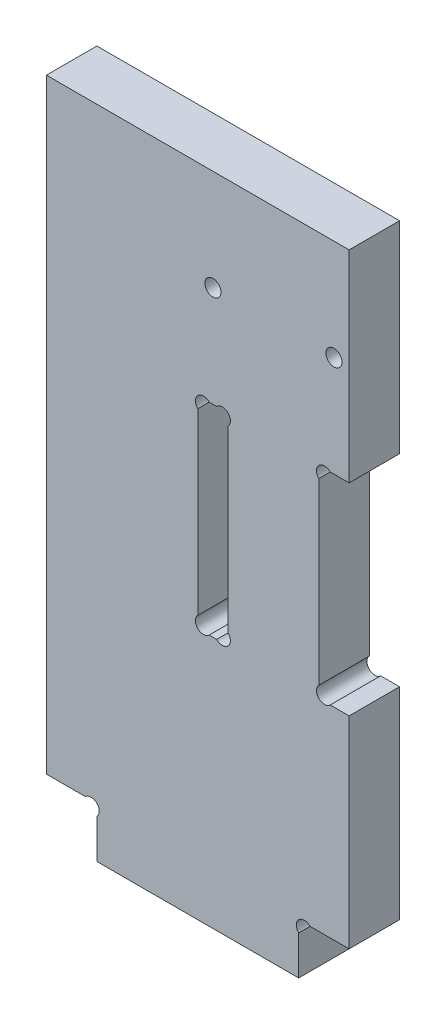
ISO-10303-21;
HEADER;
FILE_DESCRIPTION(('STEP AP214'),'2;1');
FILE_NAME('part.step','',(''),(''),'','','');
FILE_SCHEMA(('AUTOMOTIVE_DESIGN { 1 0 10303 214 1 1 1 1 }'));
ENDSEC;
DATA;
#1=APPLICATION_CONTEXT('core data for automotive mechanical design processes');
#2=APPLICATION_PROTOCOL_DEFINITION('international standard','automotive_design',2000,#1);
#3=PRODUCT_CONTEXT('',#1,'mechanical');
#4=PRODUCT('Part','Part','',(#3));
#5=PRODUCT_RELATED_PRODUCT_CATEGORY('part','',(#4));
#6=PRODUCT_DEFINITION_FORMATION('','',#4);
#7=PRODUCT_DEFINITION_CONTEXT('part definition',#1,'design');
#8=PRODUCT_DEFINITION('design','',#6,#7);
#9=PRODUCT_DEFINITION_SHAPE('','',#8);
#10=(LENGTH_UNIT() NAMED_UNIT(*) SI_UNIT(.MILLI.,.METRE.));
#11=(NAMED_UNIT(*) PLANE_ANGLE_UNIT() SI_UNIT($,.RADIAN.));
#12=(NAMED_UNIT(*) SI_UNIT($,.STERADIAN.) SOLID_ANGLE_UNIT());
#13=UNCERTAINTY_MEASURE_WITH_UNIT(LENGTH_MEASURE(1.E-05),#10,'distance_accuracy_value','');
#14=(GEOMETRIC_REPRESENTATION_CONTEXT(3) GLOBAL_UNCERTAINTY_ASSIGNED_CONTEXT((#13)) GLOBAL_UNIT_ASSIGNED_CONTEXT((#10,
#11,#12)) REPRESENTATION_CONTEXT('',''));
#15=CARTESIAN_POINT('',(0.,0.,0.));
#16=DIRECTION('',(0.,0.,1.));
#17=DIRECTION('',(1.,0.,0.));
#18=AXIS2_PLACEMENT_3D('',#15,#16,#17);
#19=CARTESIAN_POINT('',(278.868629150101,8.86862915010152,10.));
#20=DIRECTION('',(0.,0.,1.));
#21=DIRECTION('',(1.,0.,0.));
#22=AXIS2_PLACEMENT_3D('',#19,#20,#21);
#23=PLANE('',#22);
#24=CARTESIAN_POINT('',(327.,110.,10.));
#25=DIRECTION('',(0.,0.,1.));
#26=DIRECTION('',(-1.,0.,0.));
#27=AXIS2_PLACEMENT_3D('',#24,#25,#26);
#28=CIRCLE('',#27,1.59999999999996);
#29=CARTESIAN_POINT('',(325.4,110.,10.));
#30=VERTEX_POINT('',#29);
#31=EDGE_CURVE('E220',#30,#30,#28,.T.);
#32=ORIENTED_EDGE('',*,*,#31,.F.);
#33=EDGE_LOOP('',(#32));
#34=FACE_BOUND('',#33,.T.);
#35=DIRECTION('',(0.,1.,0.));
#36=VECTOR('',#35,1.);
#37=CARTESIAN_POINT('',(330.,90.0000000000001,10.));
#38=LINE('',#37,#36);
#39=CARTESIAN_POINT('',(330.,90.0000000000001,10.));
#40=VERTEX_POINT('',#39);
#41=CARTESIAN_POINT('',(330.,130.,10.));
#42=VERTEX_POINT('',#41);
#43=EDGE_CURVE('E299',#40,#42,#38,.T.);
#44=ORIENTED_EDGE('',*,*,#43,.T.);
#45=DIRECTION('',(-1.,0.,0.));
#46=VECTOR('',#45,1.);
#47=CARTESIAN_POINT('',(330.,130.,10.));
#48=LINE('',#47,#46);
#49=CARTESIAN_POINT('',(270.,130.,10.));
#50=VERTEX_POINT('',#49);
#51=EDGE_CURVE('E302',#42,#50,#48,.T.);
#52=ORIENTED_EDGE('',*,*,#51,.T.);
#53=DIRECTION('',(0.,-1.,0.));
#54=VECTOR('',#53,1.);
#55=CARTESIAN_POINT('',(270.,130.,10.));
#56=LINE('',#55,#54);
#57=CARTESIAN_POINT('',(270.,9.99999999999999,10.));
#58=VERTEX_POINT('',#57);
#59=EDGE_CURVE('E304',#50,#58,#56,.T.);
#60=ORIENTED_EDGE('',*,*,#59,.T.);
#61=DIRECTION('',(1.,0.,0.));
#62=VECTOR('',#61,1.);
#63=CARTESIAN_POINT('',(270.,9.99999999999999,10.));
#64=LINE('',#63,#62);
#65=CARTESIAN_POINT('',(277.737258300203,10.,10.));
#66=VERTEX_POINT('',#65);
#67=EDGE_CURVE('E306',#58,#66,#64,.T.);
#68=ORIENTED_EDGE('',*,*,#67,.T.);
#69=CARTESIAN_POINT('',(278.868629150101,8.86862915010152,10.));
#70=DIRECTION('',(0.,0.,-1.));
#71=DIRECTION('',(1.,0.,0.));
#72=AXIS2_PLACEMENT_3D('',#69,#70,#71);
#73=CIRCLE('',#72,1.59999999999998);
#74=CARTESIAN_POINT('',(280.,7.73725830020305,10.));
#75=VERTEX_POINT('',#74);
#76=EDGE_CURVE('E308',#66,#75,#73,.T.);
#77=ORIENTED_EDGE('',*,*,#76,.T.);
#78=DIRECTION('',(0.,-1.,0.));
#79=VECTOR('',#78,1.);
#80=CARTESIAN_POINT('',(280.,7.73725830020305,10.));
#81=LINE('',#80,#79);
#82=CARTESIAN_POINT('',(280.,0.,10.));
#83=VERTEX_POINT('',#82);
#84=EDGE_CURVE('E310',#75,#83,#81,.T.);
#85=ORIENTED_EDGE('',*,*,#84,.T.);
#86=DIRECTION('',(1.,0.,0.));
#87=VECTOR('',#86,1.);
#88=CARTESIAN_POINT('',(320.,0.,10.));
#89=LINE('',#88,#87);
#90=CARTESIAN_POINT('',(320.,0.,10.));
#91=VERTEX_POINT('',#90);
#92=EDGE_CURVE('E312',#83,#91,#89,.T.);
#93=ORIENTED_EDGE('',*,*,#92,.T.);
#94=DIRECTION('',(0.,1.,0.));
#95=VECTOR('',#94,1.);
#96=CARTESIAN_POINT('',(320.,7.73725830020305,10.));
#97=LINE('',#96,#95);
#98=CARTESIAN_POINT('',(320.,7.73725830020306,10.));
#99=VERTEX_POINT('',#98);
#100=EDGE_CURVE('E314',#91,#99,#97,.T.);
#101=ORIENTED_EDGE('',*,*,#100,.T.);
#102=CARTESIAN_POINT('',(321.131370849899,8.86862915010152,10.));
#103=DIRECTION('',(0.,0.,-1.));
#104=DIRECTION('',(-1.,0.,0.));
#105=AXIS2_PLACEMENT_3D('',#102,#103,#104);
#106=CIRCLE('',#105,1.6);
#107=CARTESIAN_POINT('',(322.262741699797,10.,10.));
#108=VERTEX_POINT('',#107);
#109=EDGE_CURVE('E316',#99,#108,#106,.T.);
#110=ORIENTED_EDGE('',*,*,#109,.T.);
#111=DIRECTION('',(1.,0.,0.));
#112=VECTOR('',#111,1.);
#113=CARTESIAN_POINT('',(322.262741699797,10.,10.));
#114=LINE('',#113,#112);
#115=CARTESIAN_POINT('',(330.,10.,10.));
#116=VERTEX_POINT('',#115);
#117=EDGE_CURVE('E318',#108,#116,#114,.T.);
#118=ORIENTED_EDGE('',*,*,#117,.T.);
#119=DIRECTION('',(0.,1.,0.));
#120=VECTOR('',#119,1.);
#121=CARTESIAN_POINT('',(330.,10.,10.));
#122=LINE('',#121,#120);
#123=CARTESIAN_POINT('',(330.,50.,10.));
#124=VERTEX_POINT('',#123);
#125=EDGE_CURVE('E320',#116,#124,#122,.T.);
#126=ORIENTED_EDGE('',*,*,#125,.T.);
#127=DIRECTION('',(-1.,0.,0.));
#128=VECTOR('',#127,1.);
#129=CARTESIAN_POINT('',(326.262741699797,50.,10.));
#130=LINE('',#129,#128);
#131=CARTESIAN_POINT('',(326.262741699797,50.,10.));
#132=VERTEX_POINT('',#131);
#133=EDGE_CURVE('E322',#124,#132,#130,.T.);
#134=ORIENTED_EDGE('',*,*,#133,.T.);
#135=CARTESIAN_POINT('',(325.131370849898,51.1313708498985,10.));
#136=DIRECTION('',(0.,0.,-1.));
#137=DIRECTION('',(-1.,0.,0.));
#138=AXIS2_PLACEMENT_3D('',#135,#136,#137);
#139=CIRCLE('',#138,1.59999999999995);
#140=CARTESIAN_POINT('',(324.,52.2627416997971,10.));
#141=VERTEX_POINT('',#140);
#142=EDGE_CURVE('E324',#132,#141,#139,.T.);
#143=ORIENTED_EDGE('',*,*,#142,.T.);
#144=DIRECTION('',(0.,1.,0.));
#145=VECTOR('',#144,1.);
#146=CARTESIAN_POINT('',(324.,87.7372583002031,10.));
#147=LINE('',#146,#145);
#148=CARTESIAN_POINT('',(324.,87.7372583002031,10.));
#149=VERTEX_POINT('',#148);
#150=EDGE_CURVE('E326',#141,#149,#147,.T.);
#151=ORIENTED_EDGE('',*,*,#150,.T.);
#152=CARTESIAN_POINT('',(325.131370849898,88.8686291501016,10.));
#153=DIRECTION('',(0.,0.,-1.));
#154=DIRECTION('',(1.,0.,0.));
#155=AXIS2_PLACEMENT_3D('',#152,#153,#154);
#156=CIRCLE('',#155,1.59999999999996);
#157=CARTESIAN_POINT('',(326.262741699797,90.0000000000001,10.));
#158=VERTEX_POINT('',#157);
#159=EDGE_CURVE('E328',#149,#158,#156,.T.);
#160=ORIENTED_EDGE('',*,*,#159,.T.);
#161=DIRECTION('',(1.,0.,0.));
#162=VECTOR('',#161,1.);
#163=CARTESIAN_POINT('',(326.262741699797,90.0000000000001,10.));
#164=LINE('',#163,#162);
#165=EDGE_CURVE('E330',#158,#40,#164,.T.);
#166=ORIENTED_EDGE('',*,*,#165,.T.);
#167=EDGE_LOOP('',(#44,#52,#60,#68,#77,#85,#93,#101,#110,#118,#126,#134,#143,#151,#160,#166));
#168=FACE_BOUND('',#167,.T.);
#169=DIRECTION('',(0.,1.,0.));
#170=VECTOR('',#169,1.);
#171=CARTESIAN_POINT('',(306.,52.2627416997969,10.));
#172=LINE('',#171,#170);
#173=CARTESIAN_POINT('',(306.,52.2627416997969,10.));
#174=VERTEX_POINT('',#173);
#175=CARTESIAN_POINT('',(306.,87.7372583002031,10.));
#176=VERTEX_POINT('',#175);
#177=EDGE_CURVE('E241',#174,#176,#172,.T.);
#178=ORIENTED_EDGE('',*,*,#177,.F.);
#179=CARTESIAN_POINT('',(304.868629150102,51.1313708498985,10.));
#180=DIRECTION('',(0.,0.,1.));
#181=DIRECTION('',(1.,0.,0.));
#182=AXIS2_PLACEMENT_3D('',#179,#180,#181);
#183=CIRCLE('',#182,1.59999999999995);
#184=CARTESIAN_POINT('',(303.737258300203,50.,10.));
#185=VERTEX_POINT('',#184);
#186=EDGE_CURVE('E212',#185,#174,#183,.T.);
#187=ORIENTED_EDGE('',*,*,#186,.F.);
#188=DIRECTION('',(1.,0.,0.));
#189=VECTOR('',#188,1.);
#190=CARTESIAN_POINT('',(302.262741699797,50.,10.));
#191=LINE('',#190,#189);
#192=CARTESIAN_POINT('',(302.262741699797,50.,10.));
#193=VERTEX_POINT('',#192);
#194=EDGE_CURVE('E253',#193,#185,#191,.T.);
#195=ORIENTED_EDGE('',*,*,#194,.F.);
#196=CARTESIAN_POINT('',(301.131370849898,51.1313708498985,10.));
#197=DIRECTION('',(0.,0.,1.));
#198=DIRECTION('',(-1.,0.,0.));
#199=AXIS2_PLACEMENT_3D('',#196,#197,#198);
#200=CIRCLE('',#199,1.59999999999997);
#201=CARTESIAN_POINT('',(300.,52.262741699797,10.));
#202=VERTEX_POINT('',#201);
#203=EDGE_CURVE('E251',#202,#193,#200,.T.);
#204=ORIENTED_EDGE('',*,*,#203,.F.);
#205=DIRECTION('',(0.,-1.,0.));
#206=VECTOR('',#205,1.);
#207=CARTESIAN_POINT('',(300.,87.7372583002031,10.));
#208=LINE('',#207,#206);
#209=CARTESIAN_POINT('',(300.,87.7372583002031,10.));
#210=VERTEX_POINT('',#209);
#211=EDGE_CURVE('E249',#210,#202,#208,.T.);
#212=ORIENTED_EDGE('',*,*,#211,.F.);
#213=CARTESIAN_POINT('',(301.131370849898,88.8686291501016,10.));
#214=DIRECTION('',(0.,0.,1.));
#215=DIRECTION('',(1.,0.,0.));
#216=AXIS2_PLACEMENT_3D('',#213,#214,#215);
#217=CIRCLE('',#216,1.59999999999995);
#218=CARTESIAN_POINT('',(302.262741699797,90.0000000000001,10.));
#219=VERTEX_POINT('',#218);
#220=EDGE_CURVE('E247',#219,#210,#217,.T.);
#221=ORIENTED_EDGE('',*,*,#220,.F.);
#222=DIRECTION('',(-1.,0.,0.));
#223=VECTOR('',#222,1.);
#224=CARTESIAN_POINT('',(302.262741699797,90.0000000000001,10.));
#225=LINE('',#224,#223);
#226=CARTESIAN_POINT('',(303.737258300203,90.0000000000001,10.));
#227=VERTEX_POINT('',#226);
#228=EDGE_CURVE('E245',#227,#219,#225,.T.);
#229=ORIENTED_EDGE('',*,*,#228,.F.);
#230=CARTESIAN_POINT('',(304.868629150102,88.8686291501016,10.));
#231=DIRECTION('',(0.,0.,1.));
#232=DIRECTION('',(-1.,0.,0.));
#233=AXIS2_PLACEMENT_3D('',#230,#231,#232);
#234=CIRCLE('',#233,1.59999999999997);
#235=EDGE_CURVE('E243',#176,#227,#234,.T.);
#236=ORIENTED_EDGE('',*,*,#235,.F.);
#237=EDGE_LOOP('',(#178,#187,#195,#204,#212,#221,#229,#236));
#238=FACE_BOUND('',#237,.T.);
#239=CARTESIAN_POINT('',(303.,110.,10.));
#240=DIRECTION('',(0.,0.,1.));
#241=DIRECTION('',(1.,0.,0.));
#242=AXIS2_PLACEMENT_3D('',#239,#240,#241);
#243=CIRCLE('',#242,1.59999999999996);
#244=CARTESIAN_POINT('',(304.6,110.,10.));
#245=VERTEX_POINT('',#244);
#246=EDGE_CURVE('E701',#245,#245,#243,.T.);
#247=ORIENTED_EDGE('',*,*,#246,.F.);
#248=EDGE_LOOP('',(#247));
#249=FACE_BOUND('',#248,.T.);
#250=ADVANCED_FACE('F36',(#34,#168,#238,#249),#23,.T.);
#251=CARTESIAN_POINT('',(278.868629150101,8.86862915010152,0.));
#252=DIRECTION('',(0.,0.,1.));
#253=DIRECTION('',(1.,0.,0.));
#254=AXIS2_PLACEMENT_3D('',#251,#252,#253);
#255=PLANE('',#254);
#256=CARTESIAN_POINT('',(327.,110.,0.));
#257=DIRECTION('',(0.,0.,1.));
#258=DIRECTION('',(-1.,0.,0.));
#259=AXIS2_PLACEMENT_3D('',#256,#257,#258);
#260=CIRCLE('',#259,1.59999999999996);
#261=CARTESIAN_POINT('',(325.4,110.,0.));
#262=VERTEX_POINT('',#261);
#263=EDGE_CURVE('E223',#262,#262,#260,.T.);
#264=ORIENTED_EDGE('',*,*,#263,.T.);
#265=EDGE_LOOP('',(#264));
#266=FACE_BOUND('',#265,.T.);
#267=DIRECTION('',(0.,1.,0.));
#268=VECTOR('',#267,1.);
#269=CARTESIAN_POINT('',(330.,90.0000000000001,0.));
#270=LINE('',#269,#268);
#271=CARTESIAN_POINT('',(330.,90.0000000000001,0.));
#272=VERTEX_POINT('',#271);
#273=CARTESIAN_POINT('',(330.,130.,0.));
#274=VERTEX_POINT('',#273);
#275=EDGE_CURVE('E213',#272,#274,#270,.T.);
#276=ORIENTED_EDGE('',*,*,#275,.F.);
#277=DIRECTION('',(1.,0.,0.));
#278=VECTOR('',#277,1.);
#279=CARTESIAN_POINT('',(326.262741699797,90.0000000000001,0.));
#280=LINE('',#279,#278);
#281=CARTESIAN_POINT('',(326.262741699797,90.0000000000001,0.));
#282=VERTEX_POINT('',#281);
#283=EDGE_CURVE('E297',#282,#272,#280,.T.);
#284=ORIENTED_EDGE('',*,*,#283,.F.);
#285=CARTESIAN_POINT('',(325.131370849898,88.8686291501016,0.));
#286=DIRECTION('',(0.,0.,-1.));
#287=DIRECTION('',(1.,0.,0.));
#288=AXIS2_PLACEMENT_3D('',#285,#286,#287);
#289=CIRCLE('',#288,1.59999999999996);
#290=CARTESIAN_POINT('',(324.,87.7372583002031,0.));
#291=VERTEX_POINT('',#290);
#292=EDGE_CURVE('E295',#291,#282,#289,.T.);
#293=ORIENTED_EDGE('',*,*,#292,.F.);
#294=DIRECTION('',(0.,1.,0.));
#295=VECTOR('',#294,1.);
#296=CARTESIAN_POINT('',(324.,87.7372583002031,0.));
#297=LINE('',#296,#295);
#298=CARTESIAN_POINT('',(324.,52.2627416997971,0.));
#299=VERTEX_POINT('',#298);
#300=EDGE_CURVE('E293',#299,#291,#297,.T.);
#301=ORIENTED_EDGE('',*,*,#300,.F.);
#302=CARTESIAN_POINT('',(325.131370849898,51.1313708498985,0.));
#303=DIRECTION('',(0.,0.,-1.));
#304=DIRECTION('',(-1.,0.,0.));
#305=AXIS2_PLACEMENT_3D('',#302,#303,#304);
#306=CIRCLE('',#305,1.59999999999995);
#307=CARTESIAN_POINT('',(326.262741699797,50.,0.));
#308=VERTEX_POINT('',#307);
#309=EDGE_CURVE('E291',#308,#299,#306,.T.);
#310=ORIENTED_EDGE('',*,*,#309,.F.);
#311=DIRECTION('',(-1.,0.,0.));
#312=VECTOR('',#311,1.);
#313=CARTESIAN_POINT('',(326.262741699797,50.,0.));
#314=LINE('',#313,#312);
#315=CARTESIAN_POINT('',(330.,50.,0.));
#316=VERTEX_POINT('',#315);
#317=EDGE_CURVE('E289',#316,#308,#314,.T.);
#318=ORIENTED_EDGE('',*,*,#317,.F.);
#319=DIRECTION('',(0.,1.,0.));
#320=VECTOR('',#319,1.);
#321=CARTESIAN_POINT('',(330.,10.,0.));
#322=LINE('',#321,#320);
#323=CARTESIAN_POINT('',(330.,10.,0.));
#324=VERTEX_POINT('',#323);
#325=EDGE_CURVE('E287',#324,#316,#322,.T.);
#326=ORIENTED_EDGE('',*,*,#325,.F.);
#327=DIRECTION('',(1.,0.,0.));
#328=VECTOR('',#327,1.);
#329=CARTESIAN_POINT('',(322.262741699797,10.,0.));
#330=LINE('',#329,#328);
#331=CARTESIAN_POINT('',(322.262741699797,10.,0.));
#332=VERTEX_POINT('',#331);
#333=EDGE_CURVE('E285',#332,#324,#330,.T.);
#334=ORIENTED_EDGE('',*,*,#333,.F.);
#335=CARTESIAN_POINT('',(321.131370849899,8.86862915010152,0.));
#336=DIRECTION('',(0.,0.,-1.));
#337=DIRECTION('',(-1.,0.,0.));
#338=AXIS2_PLACEMENT_3D('',#335,#336,#337);
#339=CIRCLE('',#338,1.6);
#340=CARTESIAN_POINT('',(320.,7.73725830020306,0.));
#341=VERTEX_POINT('',#340);
#342=EDGE_CURVE('E283',#341,#332,#339,.T.);
#343=ORIENTED_EDGE('',*,*,#342,.F.);
#344=DIRECTION('',(0.,1.,0.));
#345=VECTOR('',#344,1.);
#346=CARTESIAN_POINT('',(320.,7.73725830020305,0.));
#347=LINE('',#346,#345);
#348=CARTESIAN_POINT('',(320.,0.,0.));
#349=VERTEX_POINT('',#348);
#350=EDGE_CURVE('E281',#349,#341,#347,.T.);
#351=ORIENTED_EDGE('',*,*,#350,.F.);
#352=DIRECTION('',(1.,0.,0.));
#353=VECTOR('',#352,1.);
#354=CARTESIAN_POINT('',(320.,0.,0.));
#355=LINE('',#354,#353);
#356=CARTESIAN_POINT('',(280.,0.,0.));
#357=VERTEX_POINT('',#356);
#358=EDGE_CURVE('E279',#357,#349,#355,.T.);
#359=ORIENTED_EDGE('',*,*,#358,.F.);
#360=DIRECTION('',(0.,-1.,0.));
#361=VECTOR('',#360,1.);
#362=CARTESIAN_POINT('',(280.,7.73725830020305,0.));
#363=LINE('',#362,#361);
#364=CARTESIAN_POINT('',(280.,7.73725830020305,0.));
#365=VERTEX_POINT('',#364);
#366=EDGE_CURVE('E277',#365,#357,#363,.T.);
#367=ORIENTED_EDGE('',*,*,#366,.F.);
#368=CARTESIAN_POINT('',(278.868629150101,8.86862915010152,0.));
#369=DIRECTION('',(0.,0.,-1.));
#370=DIRECTION('',(1.,0.,0.));
#371=AXIS2_PLACEMENT_3D('',#368,#369,#370);
#372=CIRCLE('',#371,1.59999999999998);
#373=CARTESIAN_POINT('',(277.737258300203,10.,0.));
#374=VERTEX_POINT('',#373);
#375=EDGE_CURVE('E275',#374,#365,#372,.T.);
#376=ORIENTED_EDGE('',*,*,#375,.F.);
#377=DIRECTION('',(1.,0.,0.));
#378=VECTOR('',#377,1.);
#379=CARTESIAN_POINT('',(270.,9.99999999999999,0.));
#380=LINE('',#379,#378);
#381=CARTESIAN_POINT('',(270.,9.99999999999999,0.));
#382=VERTEX_POINT('',#381);
#383=EDGE_CURVE('E273',#382,#374,#380,.T.);
#384=ORIENTED_EDGE('',*,*,#383,.F.);
#385=DIRECTION('',(0.,-1.,0.));
#386=VECTOR('',#385,1.);
#387=CARTESIAN_POINT('',(270.,130.,0.));
#388=LINE('',#387,#386);
#389=CARTESIAN_POINT('',(270.,130.,0.));
#390=VERTEX_POINT('',#389);
#391=EDGE_CURVE('E271',#390,#382,#388,.T.);
#392=ORIENTED_EDGE('',*,*,#391,.F.);
#393=DIRECTION('',(-1.,0.,0.));
#394=VECTOR('',#393,1.);
#395=CARTESIAN_POINT('',(330.,130.,0.));
#396=LINE('',#395,#394);
#397=EDGE_CURVE('E269',#274,#390,#396,.T.);
#398=ORIENTED_EDGE('',*,*,#397,.F.);
#399=EDGE_LOOP('',(#276,#284,#293,#301,#310,#318,#326,#334,#343,#351,#359,#367,#376,#384,#392,#398));
#400=FACE_BOUND('',#399,.T.);
#401=CARTESIAN_POINT('',(304.868629150102,51.1313708498985,0.));
#402=DIRECTION('',(0.,0.,1.));
#403=DIRECTION('',(1.,0.,0.));
#404=AXIS2_PLACEMENT_3D('',#401,#402,#403);
#405=CIRCLE('',#404,1.59999999999995);
#406=CARTESIAN_POINT('',(303.737258300203,50.,0.));
#407=VERTEX_POINT('',#406);
#408=CARTESIAN_POINT('',(306.,52.2627416997969,0.));
#409=VERTEX_POINT('',#408);
#410=EDGE_CURVE('E59',#407,#409,#405,.T.);
#411=ORIENTED_EDGE('',*,*,#410,.T.);
#412=DIRECTION('',(0.,1.,0.));
#413=VECTOR('',#412,1.);
#414=CARTESIAN_POINT('',(306.,52.2627416997969,0.));
#415=LINE('',#414,#413);
#416=CARTESIAN_POINT('',(306.,87.7372583002031,0.));
#417=VERTEX_POINT('',#416);
#418=EDGE_CURVE('E199',#409,#417,#415,.T.);
#419=ORIENTED_EDGE('',*,*,#418,.T.);
#420=CARTESIAN_POINT('',(304.868629150102,88.8686291501016,0.));
#421=DIRECTION('',(0.,0.,1.));
#422=DIRECTION('',(-1.,0.,0.));
#423=AXIS2_PLACEMENT_3D('',#420,#421,#422);
#424=CIRCLE('',#423,1.59999999999997);
#425=CARTESIAN_POINT('',(303.737258300203,90.0000000000001,0.));
#426=VERTEX_POINT('',#425);
#427=EDGE_CURVE('E208',#417,#426,#424,.T.);
#428=ORIENTED_EDGE('',*,*,#427,.T.);
#429=DIRECTION('',(-1.,0.,0.));
#430=VECTOR('',#429,1.);
#431=CARTESIAN_POINT('',(302.262741699797,90.0000000000001,0.));
#432=LINE('',#431,#430);
#433=CARTESIAN_POINT('',(302.262741699797,90.0000000000001,0.));
#434=VERTEX_POINT('',#433);
#435=EDGE_CURVE('E228',#426,#434,#432,.T.);
#436=ORIENTED_EDGE('',*,*,#435,.T.);
#437=CARTESIAN_POINT('',(301.131370849898,88.8686291501016,0.));
#438=DIRECTION('',(0.,0.,1.));
#439=DIRECTION('',(1.,0.,0.));
#440=AXIS2_PLACEMENT_3D('',#437,#438,#439);
#441=CIRCLE('',#440,1.59999999999995);
#442=CARTESIAN_POINT('',(300.,87.7372583002031,0.));
#443=VERTEX_POINT('',#442);
#444=EDGE_CURVE('E231',#434,#443,#441,.T.);
#445=ORIENTED_EDGE('',*,*,#444,.T.);
#446=DIRECTION('',(0.,-1.,0.));
#447=VECTOR('',#446,1.);
#448=CARTESIAN_POINT('',(300.,87.7372583002031,0.));
#449=LINE('',#448,#447);
#450=CARTESIAN_POINT('',(300.,52.262741699797,0.));
#451=VERTEX_POINT('',#450);
#452=EDGE_CURVE('E234',#443,#451,#449,.T.);
#453=ORIENTED_EDGE('',*,*,#452,.T.);
#454=CARTESIAN_POINT('',(301.131370849898,51.1313708498985,0.));
#455=DIRECTION('',(0.,0.,1.));
#456=DIRECTION('',(-1.,0.,0.));
#457=AXIS2_PLACEMENT_3D('',#454,#455,#456);
#458=CIRCLE('',#457,1.59999999999997);
#459=CARTESIAN_POINT('',(302.262741699797,50.0000000000001,0.));
#460=VERTEX_POINT('',#459);
#461=EDGE_CURVE('E237',#451,#460,#458,.T.);
#462=ORIENTED_EDGE('',*,*,#461,.T.);
#463=DIRECTION('',(1.,0.,0.));
#464=VECTOR('',#463,1.);
#465=CARTESIAN_POINT('',(302.262741699797,50.,0.));
#466=LINE('',#465,#464);
#467=EDGE_CURVE('E219',#460,#407,#466,.T.);
#468=ORIENTED_EDGE('',*,*,#467,.T.);
#469=EDGE_LOOP('',(#411,#419,#428,#436,#445,#453,#462,#468));
#470=FACE_BOUND('',#469,.T.);
#471=CARTESIAN_POINT('',(303.,110.,0.));
#472=DIRECTION('',(0.,0.,1.));
#473=DIRECTION('',(1.,0.,0.));
#474=AXIS2_PLACEMENT_3D('',#471,#472,#473);
#475=CIRCLE('',#474,1.59999999999996);
#476=CARTESIAN_POINT('',(304.6,110.,0.));
#477=VERTEX_POINT('',#476);
#478=EDGE_CURVE('E704',#477,#477,#475,.T.);
#479=ORIENTED_EDGE('',*,*,#478,.T.);
#480=EDGE_LOOP('',(#479));
#481=FACE_BOUND('',#480,.T.);
#482=ADVANCED_FACE('F216',(#266,#400,#470,#481),#255,.F.);
#483=CARTESIAN_POINT('',(330.,90.0000000000001,10.));
#484=DIRECTION('',(-1.,0.,0.));
#485=DIRECTION('',(0.,-1.,0.));
#486=AXIS2_PLACEMENT_3D('',#483,#484,#485);
#487=PLANE('',#486);
#488=ORIENTED_EDGE('',*,*,#275,.T.);
#489=DIRECTION('',(0.,0.,-1.));
#490=VECTOR('',#489,1.);
#491=CARTESIAN_POINT('',(330.,130.,10.));
#492=LINE('',#491,#490);
#493=EDGE_CURVE('E11',#42,#274,#492,.T.);
#494=ORIENTED_EDGE('',*,*,#493,.F.);
#495=ORIENTED_EDGE('',*,*,#43,.F.);
#496=DIRECTION('',(0.,0.,-1.));
#497=VECTOR('',#496,1.);
#498=CARTESIAN_POINT('',(330.,90.0000000000001,10.));
#499=LINE('',#498,#497);
#500=EDGE_CURVE('E332',#40,#272,#499,.T.);
#501=ORIENTED_EDGE('',*,*,#500,.T.);
#502=EDGE_LOOP('',(#488,#494,#495,#501));
#503=FACE_BOUND('',#502,.T.);
#504=ADVANCED_FACE('F38',(#503),#487,.F.);
#505=CARTESIAN_POINT('',(330.,130.,10.));
#506=DIRECTION('',(0.,-1.,0.));
#507=DIRECTION('',(0.,0.,-1.));
#508=AXIS2_PLACEMENT_3D('',#505,#506,#507);
#509=PLANE('',#508);
#510=ORIENTED_EDGE('',*,*,#397,.T.);
#511=DIRECTION('',(0.,0.,-1.));
#512=VECTOR('',#511,1.);
#513=CARTESIAN_POINT('',(270.,130.,10.));
#514=LINE('',#513,#512);
#515=EDGE_CURVE('E44',#50,#390,#514,.T.);
#516=ORIENTED_EDGE('',*,*,#515,.F.);
#517=ORIENTED_EDGE('',*,*,#51,.F.);
#518=ORIENTED_EDGE('',*,*,#493,.T.);
#519=EDGE_LOOP('',(#510,#516,#517,#518));
#520=FACE_BOUND('',#519,.T.);
#521=ADVANCED_FACE('F400',(#520),#509,.F.);
#522=CARTESIAN_POINT('',(270.,130.,10.));
#523=DIRECTION('',(1.,0.,0.));
#524=DIRECTION('',(0.,0.,-1.));
#525=AXIS2_PLACEMENT_3D('',#522,#523,#524);
#526=PLANE('',#525);
#527=ORIENTED_EDGE('',*,*,#391,.T.);
#528=DIRECTION('',(0.,0.,-1.));
#529=VECTOR('',#528,1.);
#530=CARTESIAN_POINT('',(270.,9.99999999999999,10.));
#531=LINE('',#530,#529);
#532=EDGE_CURVE('E371',#58,#382,#531,.T.);
#533=ORIENTED_EDGE('',*,*,#532,.F.);
#534=ORIENTED_EDGE('',*,*,#59,.F.);
#535=ORIENTED_EDGE('',*,*,#515,.T.);
#536=EDGE_LOOP('',(#527,#533,#534,#535));
#537=FACE_BOUND('',#536,.T.);
#538=ADVANCED_FACE('F378',(#537),#526,.F.);
#539=CARTESIAN_POINT('',(270.,9.99999999999999,10.));
#540=DIRECTION('',(0.,1.,0.));
#541=DIRECTION('',(-1.,0.,0.));
#542=AXIS2_PLACEMENT_3D('',#539,#540,#541);
#543=PLANE('',#542);
#544=ORIENTED_EDGE('',*,*,#383,.T.);
#545=DIRECTION('',(0.,0.,-1.));
#546=VECTOR('',#545,1.);
#547=CARTESIAN_POINT('',(277.737258300203,10.,10.));
#548=LINE('',#547,#546);
#549=EDGE_CURVE('E368',#66,#374,#548,.T.);
#550=ORIENTED_EDGE('',*,*,#549,.F.);
#551=ORIENTED_EDGE('',*,*,#67,.F.);
#552=ORIENTED_EDGE('',*,*,#532,.T.);
#553=EDGE_LOOP('',(#544,#550,#551,#552));
#554=FACE_BOUND('',#553,.T.);
#555=ADVANCED_FACE('F388',(#554),#543,.F.);
#556=CARTESIAN_POINT('',(278.868629150101,8.86862915010152,10.));
#557=DIRECTION('',(0.,0.,-1.));
#558=DIRECTION('',(-1.,0.,0.));
#559=AXIS2_PLACEMENT_3D('',#556,#557,#558);
#560=CYLINDRICAL_SURFACE('',#559,1.59999999999998);
#561=ORIENTED_EDGE('',*,*,#375,.T.);
#562=DIRECTION('',(0.,0.,-1.));
#563=VECTOR('',#562,1.);
#564=CARTESIAN_POINT('',(280.,7.73725830020305,10.));
#565=LINE('',#564,#563);
#566=EDGE_CURVE('E365',#75,#365,#565,.T.);
#567=ORIENTED_EDGE('',*,*,#566,.F.);
#568=ORIENTED_EDGE('',*,*,#76,.F.);
#569=ORIENTED_EDGE('',*,*,#549,.T.);
#570=EDGE_LOOP('',(#561,#567,#568,#569));
#571=FACE_BOUND('',#570,.T.);
#572=ADVANCED_FACE('F392',(#571),#560,.F.);
#573=CARTESIAN_POINT('',(280.,7.73725830020305,10.));
#574=DIRECTION('',(1.,0.,0.));
#575=DIRECTION('',(0.,0.,-1.));
#576=AXIS2_PLACEMENT_3D('',#573,#574,#575);
#577=PLANE('',#576);
#578=ORIENTED_EDGE('',*,*,#366,.T.);
#579=DIRECTION('',(0.,0.,-1.));
#580=VECTOR('',#579,1.);
#581=CARTESIAN_POINT('',(280.,0.,10.));
#582=LINE('',#581,#580);
#583=EDGE_CURVE('E362',#83,#357,#582,.T.);
#584=ORIENTED_EDGE('',*,*,#583,.F.);
#585=ORIENTED_EDGE('',*,*,#84,.F.);
#586=ORIENTED_EDGE('',*,*,#566,.T.);
#587=EDGE_LOOP('',(#578,#584,#585,#586));
#588=FACE_BOUND('',#587,.T.);
#589=ADVANCED_FACE('F453',(#588),#577,.F.);
#590=CARTESIAN_POINT('',(320.,0.,10.));
#591=DIRECTION('',(0.,1.,0.));
#592=DIRECTION('',(-1.,0.,0.));
#593=AXIS2_PLACEMENT_3D('',#590,#591,#592);
#594=PLANE('',#593);
#595=ORIENTED_EDGE('',*,*,#358,.T.);
#596=DIRECTION('',(0.,0.,-1.));
#597=VECTOR('',#596,1.);
#598=CARTESIAN_POINT('',(320.,0.,10.));
#599=LINE('',#598,#597);
#600=EDGE_CURVE('E359',#91,#349,#599,.T.);
#601=ORIENTED_EDGE('',*,*,#600,.F.);
#602=ORIENTED_EDGE('',*,*,#92,.F.);
#603=ORIENTED_EDGE('',*,*,#583,.T.);
#604=EDGE_LOOP('',(#595,#601,#602,#603));
#605=FACE_BOUND('',#604,.T.);
#606=ADVANCED_FACE('F450',(#605),#594,.F.);
#607=CARTESIAN_POINT('',(320.,7.73725830020305,10.));
#608=DIRECTION('',(-1.,0.,0.));
#609=DIRECTION('',(0.,0.,1.));
#610=AXIS2_PLACEMENT_3D('',#607,#608,#609);
#611=PLANE('',#610);
#612=ORIENTED_EDGE('',*,*,#350,.T.);
#613=DIRECTION('',(0.,0.,-1.));
#614=VECTOR('',#613,1.);
#615=CARTESIAN_POINT('',(320.,7.73725830020306,10.));
#616=LINE('',#615,#614);
#617=EDGE_CURVE('E356',#99,#341,#616,.T.);
#618=ORIENTED_EDGE('',*,*,#617,.F.);
#619=ORIENTED_EDGE('',*,*,#100,.F.);
#620=ORIENTED_EDGE('',*,*,#600,.T.);
#621=EDGE_LOOP('',(#612,#618,#619,#620));
#622=FACE_BOUND('',#621,.T.);
#623=ADVANCED_FACE('F446',(#622),#611,.F.);
#624=CARTESIAN_POINT('',(321.131370849899,8.86862915010152,10.));
#625=DIRECTION('',(0.,0.,-1.));
#626=DIRECTION('',(-1.,0.,0.));
#627=AXIS2_PLACEMENT_3D('',#624,#625,#626);
#628=CYLINDRICAL_SURFACE('',#627,1.6);
#629=ORIENTED_EDGE('',*,*,#342,.T.);
#630=DIRECTION('',(0.,0.,-1.));
#631=VECTOR('',#630,1.);
#632=CARTESIAN_POINT('',(322.262741699797,10.,10.));
#633=LINE('',#632,#631);
#634=EDGE_CURVE('E353',#108,#332,#633,.T.);
#635=ORIENTED_EDGE('',*,*,#634,.F.);
#636=ORIENTED_EDGE('',*,*,#109,.F.);
#637=ORIENTED_EDGE('',*,*,#617,.T.);
#638=EDGE_LOOP('',(#629,#635,#636,#637));
#639=FACE_BOUND('',#638,.T.);
#640=ADVANCED_FACE('F442',(#639),#628,.F.);
#641=CARTESIAN_POINT('',(322.262741699797,10.,10.));
#642=DIRECTION('',(0.,1.,0.));
#643=DIRECTION('',(-1.,0.,0.));
#644=AXIS2_PLACEMENT_3D('',#641,#642,#643);
#645=PLANE('',#644);
#646=ORIENTED_EDGE('',*,*,#333,.T.);
#647=DIRECTION('',(0.,0.,-1.));
#648=VECTOR('',#647,1.);
#649=CARTESIAN_POINT('',(330.,10.,10.));
#650=LINE('',#649,#648);
#651=EDGE_CURVE('E350',#116,#324,#650,.T.);
#652=ORIENTED_EDGE('',*,*,#651,.F.);
#653=ORIENTED_EDGE('',*,*,#117,.F.);
#654=ORIENTED_EDGE('',*,*,#634,.T.);
#655=EDGE_LOOP('',(#646,#652,#653,#654));
#656=FACE_BOUND('',#655,.T.);
#657=ADVANCED_FACE('F437',(#656),#645,.F.);
#658=CARTESIAN_POINT('',(330.,10.,10.));
#659=DIRECTION('',(-1.,0.,0.));
#660=DIRECTION('',(0.,-1.,0.));
#661=AXIS2_PLACEMENT_3D('',#658,#659,#660);
#662=PLANE('',#661);
#663=ORIENTED_EDGE('',*,*,#325,.T.);
#664=DIRECTION('',(0.,0.,-1.));
#665=VECTOR('',#664,1.);
#666=CARTESIAN_POINT('',(330.,50.,10.));
#667=LINE('',#666,#665);
#668=EDGE_CURVE('E347',#124,#316,#667,.T.);
#669=ORIENTED_EDGE('',*,*,#668,.F.);
#670=ORIENTED_EDGE('',*,*,#125,.F.);
#671=ORIENTED_EDGE('',*,*,#651,.T.);
#672=EDGE_LOOP('',(#663,#669,#670,#671));
#673=FACE_BOUND('',#672,.T.);
#674=ADVANCED_FACE('F431',(#673),#662,.F.);
#675=CARTESIAN_POINT('',(326.262741699797,50.,10.));
#676=DIRECTION('',(0.,-1.,0.));
#677=DIRECTION('',(1.,0.,0.));
#678=AXIS2_PLACEMENT_3D('',#675,#676,#677);
#679=PLANE('',#678);
#680=ORIENTED_EDGE('',*,*,#317,.T.);
#681=DIRECTION('',(0.,0.,-1.));
#682=VECTOR('',#681,1.);
#683=CARTESIAN_POINT('',(326.262741699797,50.,10.));
#684=LINE('',#683,#682);
#685=EDGE_CURVE('E344',#132,#308,#684,.T.);
#686=ORIENTED_EDGE('',*,*,#685,.F.);
#687=ORIENTED_EDGE('',*,*,#133,.F.);
#688=ORIENTED_EDGE('',*,*,#668,.T.);
#689=EDGE_LOOP('',(#680,#686,#687,#688));
#690=FACE_BOUND('',#689,.T.);
#691=ADVANCED_FACE('F427',(#690),#679,.F.);
#692=CARTESIAN_POINT('',(325.131370849898,51.1313708498985,10.));
#693=DIRECTION('',(0.,0.,-1.));
#694=DIRECTION('',(-1.,0.,0.));
#695=AXIS2_PLACEMENT_3D('',#692,#693,#694);
#696=CYLINDRICAL_SURFACE('',#695,1.59999999999995);
#697=ORIENTED_EDGE('',*,*,#309,.T.);
#698=DIRECTION('',(0.,0.,-1.));
#699=VECTOR('',#698,1.);
#700=CARTESIAN_POINT('',(324.,52.2627416997971,10.));
#701=LINE('',#700,#699);
#702=EDGE_CURVE('E341',#141,#299,#701,.T.);
#703=ORIENTED_EDGE('',*,*,#702,.F.);
#704=ORIENTED_EDGE('',*,*,#142,.F.);
#705=ORIENTED_EDGE('',*,*,#685,.T.);
#706=EDGE_LOOP('',(#697,#703,#704,#705));
#707=FACE_BOUND('',#706,.T.);
#708=ADVANCED_FACE('F422',(#707),#696,.F.);
#709=CARTESIAN_POINT('',(324.,87.7372583002031,10.));
#710=DIRECTION('',(-1.,0.,0.));
#711=DIRECTION('',(0.,0.,1.));
#712=AXIS2_PLACEMENT_3D('',#709,#710,#711);
#713=PLANE('',#712);
#714=ORIENTED_EDGE('',*,*,#300,.T.);
#715=DIRECTION('',(0.,0.,-1.));
#716=VECTOR('',#715,1.);
#717=CARTESIAN_POINT('',(324.,87.7372583002031,10.));
#718=LINE('',#717,#716);
#719=EDGE_CURVE('E338',#149,#291,#718,.T.);
#720=ORIENTED_EDGE('',*,*,#719,.F.);
#721=ORIENTED_EDGE('',*,*,#150,.F.);
#722=ORIENTED_EDGE('',*,*,#702,.T.);
#723=EDGE_LOOP('',(#714,#720,#721,#722));
#724=FACE_BOUND('',#723,.T.);
#725=ADVANCED_FACE('F416',(#724),#713,.F.);
#726=CARTESIAN_POINT('',(325.131370849898,88.8686291501016,10.));
#727=DIRECTION('',(0.,0.,-1.));
#728=DIRECTION('',(-1.,0.,0.));
#729=AXIS2_PLACEMENT_3D('',#726,#727,#728);
#730=CYLINDRICAL_SURFACE('',#729,1.59999999999996);
#731=ORIENTED_EDGE('',*,*,#292,.T.);
#732=DIRECTION('',(0.,0.,-1.));
#733=VECTOR('',#732,1.);
#734=CARTESIAN_POINT('',(326.262741699797,90.0000000000001,10.));
#735=LINE('',#734,#733);
#736=EDGE_CURVE('E335',#158,#282,#735,.T.);
#737=ORIENTED_EDGE('',*,*,#736,.F.);
#738=ORIENTED_EDGE('',*,*,#159,.F.);
#739=ORIENTED_EDGE('',*,*,#719,.T.);
#740=EDGE_LOOP('',(#731,#737,#738,#739));
#741=FACE_BOUND('',#740,.T.);
#742=ADVANCED_FACE('F412',(#741),#730,.F.);
#743=CARTESIAN_POINT('',(326.262741699797,90.0000000000001,10.));
#744=DIRECTION('',(0.,1.,0.));
#745=DIRECTION('',(0.,0.,1.));
#746=AXIS2_PLACEMENT_3D('',#743,#744,#745);
#747=PLANE('',#746);
#748=ORIENTED_EDGE('',*,*,#283,.T.);
#749=ORIENTED_EDGE('',*,*,#500,.F.);
#750=ORIENTED_EDGE('',*,*,#165,.F.);
#751=ORIENTED_EDGE('',*,*,#736,.T.);
#752=EDGE_LOOP('',(#748,#749,#750,#751));
#753=FACE_BOUND('',#752,.T.);
#754=ADVANCED_FACE('F407',(#753),#747,.F.);
#755=CARTESIAN_POINT('',(304.868629150102,51.1313708498985,10.));
#756=DIRECTION('',(0.,0.,-1.));
#757=DIRECTION('',(-1.,0.,0.));
#758=AXIS2_PLACEMENT_3D('',#755,#756,#757);
#759=CYLINDRICAL_SURFACE('',#758,1.59999999999995);
#760=ORIENTED_EDGE('',*,*,#410,.F.);
#761=DIRECTION('',(0.,0.,-1.));
#762=VECTOR('',#761,1.);
#763=CARTESIAN_POINT('',(303.737258300203,50.,10.));
#764=LINE('',#763,#762);
#765=EDGE_CURVE('E255',#185,#407,#764,.T.);
#766=ORIENTED_EDGE('',*,*,#765,.F.);
#767=ORIENTED_EDGE('',*,*,#186,.T.);
#768=DIRECTION('',(0.,0.,-1.));
#769=VECTOR('',#768,1.);
#770=CARTESIAN_POINT('',(306.,52.2627416997969,10.));
#771=LINE('',#770,#769);
#772=EDGE_CURVE('E201',#174,#409,#771,.T.);
#773=ORIENTED_EDGE('',*,*,#772,.T.);
#774=EDGE_LOOP('',(#760,#766,#767,#773));
#775=FACE_BOUND('',#774,.T.);
#776=ADVANCED_FACE('F210',(#775),#759,.F.);
#777=CARTESIAN_POINT('',(306.,52.2627416997969,10.));
#778=DIRECTION('',(-1.,0.,0.));
#779=DIRECTION('',(0.,0.,1.));
#780=AXIS2_PLACEMENT_3D('',#777,#778,#779);
#781=PLANE('',#780);
#782=ORIENTED_EDGE('',*,*,#418,.F.);
#783=ORIENTED_EDGE('',*,*,#772,.F.);
#784=ORIENTED_EDGE('',*,*,#177,.T.);
#785=DIRECTION('',(0.,0.,-1.));
#786=VECTOR('',#785,1.);
#787=CARTESIAN_POINT('',(306.,87.7372583002031,10.));
#788=LINE('',#787,#786);
#789=EDGE_CURVE('E204',#176,#417,#788,.T.);
#790=ORIENTED_EDGE('',*,*,#789,.T.);
#791=EDGE_LOOP('',(#782,#783,#784,#790));
#792=FACE_BOUND('',#791,.T.);
#793=ADVANCED_FACE('F200',(#792),#781,.T.);
#794=CARTESIAN_POINT('',(304.868629150102,88.8686291501016,10.));
#795=DIRECTION('',(0.,0.,-1.));
#796=DIRECTION('',(-1.,0.,0.));
#797=AXIS2_PLACEMENT_3D('',#794,#795,#796);
#798=CYLINDRICAL_SURFACE('',#797,1.59999999999997);
#799=ORIENTED_EDGE('',*,*,#427,.F.);
#800=ORIENTED_EDGE('',*,*,#789,.F.);
#801=ORIENTED_EDGE('',*,*,#235,.T.);
#802=DIRECTION('',(0.,0.,-1.));
#803=VECTOR('',#802,1.);
#804=CARTESIAN_POINT('',(303.737258300203,90.0000000000001,10.));
#805=LINE('',#804,#803);
#806=EDGE_CURVE('E264',#227,#426,#805,.T.);
#807=ORIENTED_EDGE('',*,*,#806,.T.);
#808=EDGE_LOOP('',(#799,#800,#801,#807));
#809=FACE_BOUND('',#808,.T.);
#810=ADVANCED_FACE('F537',(#809),#798,.F.);
#811=CARTESIAN_POINT('',(302.262741699797,90.0000000000001,10.));
#812=DIRECTION('',(0.,-1.,0.));
#813=DIRECTION('',(1.,0.,0.));
#814=AXIS2_PLACEMENT_3D('',#811,#812,#813);
#815=PLANE('',#814);
#816=ORIENTED_EDGE('',*,*,#435,.F.);
#817=ORIENTED_EDGE('',*,*,#806,.F.);
#818=ORIENTED_EDGE('',*,*,#228,.T.);
#819=DIRECTION('',(0.,0.,-1.));
#820=VECTOR('',#819,1.);
#821=CARTESIAN_POINT('',(302.262741699797,90.0000000000001,10.));
#822=LINE('',#821,#820);
#823=EDGE_CURVE('E262',#219,#434,#822,.T.);
#824=ORIENTED_EDGE('',*,*,#823,.T.);
#825=EDGE_LOOP('',(#816,#817,#818,#824));
#826=FACE_BOUND('',#825,.T.);
#827=ADVANCED_FACE('F544',(#826),#815,.T.);
#828=CARTESIAN_POINT('',(301.131370849898,88.8686291501016,10.));
#829=DIRECTION('',(0.,0.,-1.));
#830=DIRECTION('',(-1.,0.,0.));
#831=AXIS2_PLACEMENT_3D('',#828,#829,#830);
#832=CYLINDRICAL_SURFACE('',#831,1.59999999999995);
#833=ORIENTED_EDGE('',*,*,#444,.F.);
#834=ORIENTED_EDGE('',*,*,#823,.F.);
#835=ORIENTED_EDGE('',*,*,#220,.T.);
#836=DIRECTION('',(0.,0.,-1.));
#837=VECTOR('',#836,1.);
#838=CARTESIAN_POINT('',(300.,87.7372583002031,10.));
#839=LINE('',#838,#837);
#840=EDGE_CURVE('E260',#210,#443,#839,.T.);
#841=ORIENTED_EDGE('',*,*,#840,.T.);
#842=EDGE_LOOP('',(#833,#834,#835,#841));
#843=FACE_BOUND('',#842,.T.);
#844=ADVANCED_FACE('F552',(#843),#832,.F.);
#845=CARTESIAN_POINT('',(300.,87.7372583002031,10.));
#846=DIRECTION('',(1.,0.,0.));
#847=DIRECTION('',(0.,0.,-1.));
#848=AXIS2_PLACEMENT_3D('',#845,#846,#847);
#849=PLANE('',#848);
#850=ORIENTED_EDGE('',*,*,#452,.F.);
#851=ORIENTED_EDGE('',*,*,#840,.F.);
#852=ORIENTED_EDGE('',*,*,#211,.T.);
#853=DIRECTION('',(0.,0.,-1.));
#854=VECTOR('',#853,1.);
#855=CARTESIAN_POINT('',(300.,52.262741699797,10.));
#856=LINE('',#855,#854);
#857=EDGE_CURVE('E258',#202,#451,#856,.T.);
#858=ORIENTED_EDGE('',*,*,#857,.T.);
#859=EDGE_LOOP('',(#850,#851,#852,#858));
#860=FACE_BOUND('',#859,.T.);
#861=ADVANCED_FACE('F560',(#860),#849,.T.);
#862=CARTESIAN_POINT('',(301.131370849898,51.1313708498985,10.));
#863=DIRECTION('',(0.,0.,-1.));
#864=DIRECTION('',(-1.,0.,0.));
#865=AXIS2_PLACEMENT_3D('',#862,#863,#864);
#866=CYLINDRICAL_SURFACE('',#865,1.59999999999997);
#867=ORIENTED_EDGE('',*,*,#461,.F.);
#868=ORIENTED_EDGE('',*,*,#857,.F.);
#869=ORIENTED_EDGE('',*,*,#203,.T.);
#870=DIRECTION('',(0.,0.,-1.));
#871=VECTOR('',#870,1.);
#872=CARTESIAN_POINT('',(302.262741699797,50.0000000000001,10.));
#873=LINE('',#872,#871);
#874=EDGE_CURVE('E51',#193,#460,#873,.T.);
#875=ORIENTED_EDGE('',*,*,#874,.T.);
#876=EDGE_LOOP('',(#867,#868,#869,#875));
#877=FACE_BOUND('',#876,.T.);
#878=ADVANCED_FACE('F568',(#877),#866,.F.);
#879=CARTESIAN_POINT('',(302.262741699797,50.,10.));
#880=DIRECTION('',(0.,1.,0.));
#881=DIRECTION('',(-1.,0.,0.));
#882=AXIS2_PLACEMENT_3D('',#879,#880,#881);
#883=PLANE('',#882);
#884=ORIENTED_EDGE('',*,*,#467,.F.);
#885=ORIENTED_EDGE('',*,*,#874,.F.);
#886=ORIENTED_EDGE('',*,*,#194,.T.);
#887=ORIENTED_EDGE('',*,*,#765,.T.);
#888=EDGE_LOOP('',(#884,#885,#886,#887));
#889=FACE_BOUND('',#888,.T.);
#890=ADVANCED_FACE('F576',(#889),#883,.T.);
#891=CARTESIAN_POINT('',(327.,110.,10.));
#892=DIRECTION('',(0.,0.,-1.));
#893=DIRECTION('',(-1.,0.,0.));
#894=AXIS2_PLACEMENT_3D('',#891,#892,#893);
#895=CYLINDRICAL_SURFACE('',#894,1.59999999999996);
#896=ORIENTED_EDGE('',*,*,#31,.T.);
#897=EDGE_LOOP('',(#896));
#898=FACE_BOUND('',#897,.T.);
#899=ORIENTED_EDGE('',*,*,#263,.F.);
#900=EDGE_LOOP('',(#899));
#901=FACE_BOUND('',#900,.T.);
#902=ADVANCED_FACE('F584',(#898,#901),#895,.F.);
#903=CARTESIAN_POINT('',(303.,110.,10.));
#904=DIRECTION('',(0.,0.,-1.));
#905=DIRECTION('',(-1.,0.,0.));
#906=AXIS2_PLACEMENT_3D('',#903,#904,#905);
#907=CYLINDRICAL_SURFACE('',#906,1.59999999999996);
#908=ORIENTED_EDGE('',*,*,#246,.T.);
#909=EDGE_LOOP('',(#908));
#910=FACE_BOUND('',#909,.T.);
#911=ORIENTED_EDGE('',*,*,#478,.F.);
#912=EDGE_LOOP('',(#911));
#913=FACE_BOUND('',#912,.T.);
#914=ADVANCED_FACE('F591',(#910,#913),#907,.F.);
#915=CLOSED_SHELL('',(#250,#482,#504,#521,#538,#555,#572,#589,#606,#623,#640,#657,#674,#691,
#708,#725,#742,#754,#776,#793,#810,#827,#844,#861,#878,#890,#902,#914));
#916=MANIFOLD_SOLID_BREP('B2',#915);
#917=ADVANCED_BREP_SHAPE_REPRESENTATION('',(#18,#916),#14);
#918=SHAPE_DEFINITION_REPRESENTATION(#9,#917);
ENDSEC;
END-ISO-10303-21;
